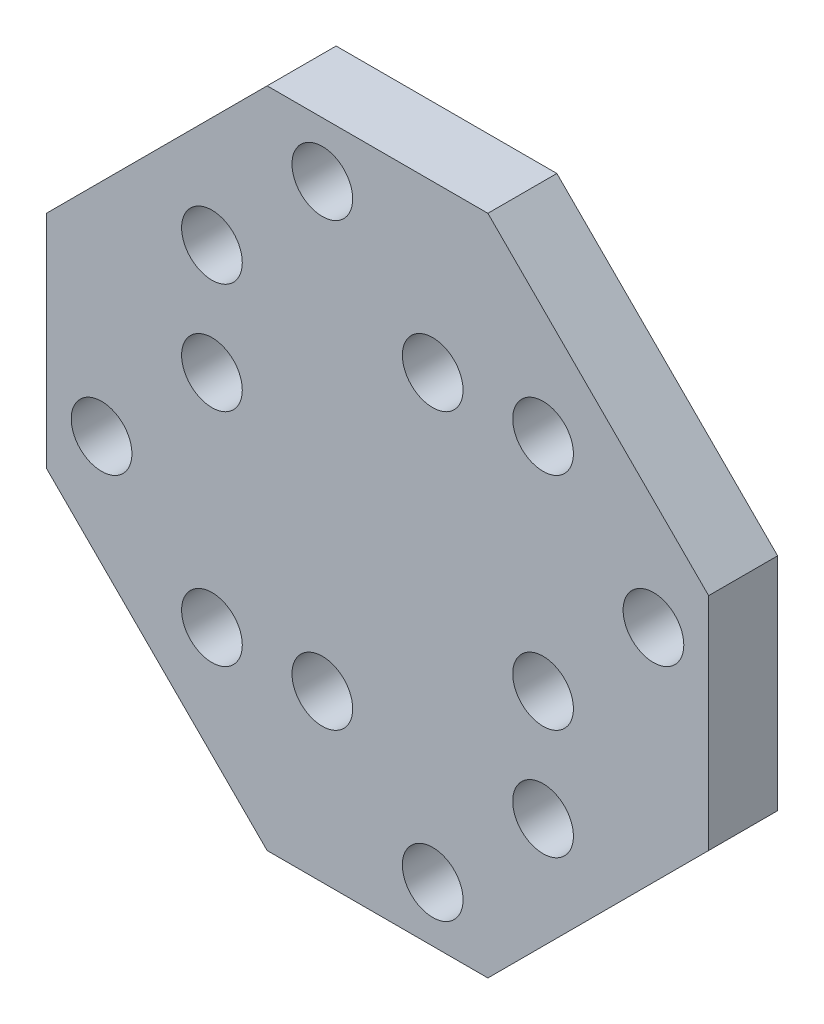
ISO-10303-21;
HEADER;
FILE_DESCRIPTION(('STEP AP214'),'2;1');
FILE_NAME('part.step','',(''),(''),'','','');
FILE_SCHEMA(('AUTOMOTIVE_DESIGN { 1 0 10303 214 1 1 1 1 }'));
ENDSEC;
DATA;
#1=APPLICATION_CONTEXT('core data for automotive mechanical design processes');
#2=APPLICATION_PROTOCOL_DEFINITION('international standard','automotive_design',2000,#1);
#3=PRODUCT_CONTEXT('',#1,'mechanical');
#4=PRODUCT('Part','Part','',(#3));
#5=PRODUCT_RELATED_PRODUCT_CATEGORY('part','',(#4));
#6=PRODUCT_DEFINITION_FORMATION('','',#4);
#7=PRODUCT_DEFINITION_CONTEXT('part definition',#1,'design');
#8=PRODUCT_DEFINITION('design','',#6,#7);
#9=PRODUCT_DEFINITION_SHAPE('','',#8);
#10=(LENGTH_UNIT() NAMED_UNIT(*) SI_UNIT(.MILLI.,.METRE.));
#11=(NAMED_UNIT(*) PLANE_ANGLE_UNIT() SI_UNIT($,.RADIAN.));
#12=(NAMED_UNIT(*) SI_UNIT($,.STERADIAN.) SOLID_ANGLE_UNIT());
#13=UNCERTAINTY_MEASURE_WITH_UNIT(LENGTH_MEASURE(1.E-05),#10,'distance_accuracy_value','');
#14=(GEOMETRIC_REPRESENTATION_CONTEXT(3) GLOBAL_UNCERTAINTY_ASSIGNED_CONTEXT((#13)) GLOBAL_UNIT_ASSIGNED_CONTEXT((#10,
#11,#12)) REPRESENTATION_CONTEXT('',''));
#15=CARTESIAN_POINT('',(0.,0.,0.));
#16=DIRECTION('',(0.,0.,1.));
#17=DIRECTION('',(1.,0.,0.));
#18=AXIS2_PLACEMENT_3D('',#15,#16,#17);
#19=CARTESIAN_POINT('',(0.,0.,2.5));
#20=DIRECTION('',(0.,0.,1.));
#21=DIRECTION('',(1.,0.,0.));
#22=AXIS2_PLACEMENT_3D('',#19,#20,#21);
#23=PLANE('',#22);
#24=CARTESIAN_POINT('',(6.,-6.,2.5));
#25=DIRECTION('',(0.,0.,1.));
#26=DIRECTION('',(1.,0.,0.));
#27=AXIS2_PLACEMENT_3D('',#24,#25,#26);
#28=CIRCLE('',#27,1.1);
#29=CARTESIAN_POINT('',(7.1,-6.,2.5));
#30=VERTEX_POINT('',#29);
#31=EDGE_CURVE('E240',#30,#30,#28,.T.);
#32=ORIENTED_EDGE('',*,*,#31,.F.);
#33=EDGE_LOOP('',(#32));
#34=FACE_BOUND('',#33,.T.);
#35=CARTESIAN_POINT('',(6.,6.,2.5));
#36=DIRECTION('',(0.,0.,1.));
#37=DIRECTION('',(1.,0.,0.));
#38=AXIS2_PLACEMENT_3D('',#35,#36,#37);
#39=CIRCLE('',#38,1.1);
#40=CARTESIAN_POINT('',(7.1,6.,2.5));
#41=VERTEX_POINT('',#40);
#42=EDGE_CURVE('E228',#41,#41,#39,.T.);
#43=ORIENTED_EDGE('',*,*,#42,.F.);
#44=EDGE_LOOP('',(#43));
#45=FACE_BOUND('',#44,.T.);
#46=CARTESIAN_POINT('',(-6.,2.,2.5));
#47=DIRECTION('',(0.,0.,1.));
#48=DIRECTION('',(1.,0.,0.));
#49=AXIS2_PLACEMENT_3D('',#46,#47,#48);
#50=CIRCLE('',#49,1.1);
#51=CARTESIAN_POINT('',(-4.9,2.,2.5));
#52=VERTEX_POINT('',#51);
#53=EDGE_CURVE('E216',#52,#52,#50,.T.);
#54=ORIENTED_EDGE('',*,*,#53,.F.);
#55=EDGE_LOOP('',(#54));
#56=FACE_BOUND('',#55,.T.);
#57=CARTESIAN_POINT('',(2.,-10.,2.5));
#58=DIRECTION('',(0.,0.,1.));
#59=DIRECTION('',(1.,0.,0.));
#60=AXIS2_PLACEMENT_3D('',#57,#58,#59);
#61=CIRCLE('',#60,1.1);
#62=CARTESIAN_POINT('',(3.1,-10.,2.5));
#63=VERTEX_POINT('',#62);
#64=EDGE_CURVE('E204',#63,#63,#61,.T.);
#65=ORIENTED_EDGE('',*,*,#64,.F.);
#66=EDGE_LOOP('',(#65));
#67=FACE_BOUND('',#66,.T.);
#68=CARTESIAN_POINT('',(10.,2.,2.5));
#69=DIRECTION('',(0.,0.,1.));
#70=DIRECTION('',(1.,0.,0.));
#71=AXIS2_PLACEMENT_3D('',#68,#69,#70);
#72=CIRCLE('',#71,1.1);
#73=CARTESIAN_POINT('',(11.1,2.,2.5));
#74=VERTEX_POINT('',#73);
#75=EDGE_CURVE('E192',#74,#74,#72,.T.);
#76=ORIENTED_EDGE('',*,*,#75,.F.);
#77=EDGE_LOOP('',(#76));
#78=FACE_BOUND('',#77,.T.);
#79=CARTESIAN_POINT('',(-2.,10.,2.5));
#80=DIRECTION('',(0.,0.,1.));
#81=DIRECTION('',(1.,0.,0.));
#82=AXIS2_PLACEMENT_3D('',#79,#80,#81);
#83=CIRCLE('',#82,1.1);
#84=CARTESIAN_POINT('',(-0.900000000000001,10.,2.5));
#85=VERTEX_POINT('',#84);
#86=EDGE_CURVE('E138',#85,#85,#83,.T.);
#87=ORIENTED_EDGE('',*,*,#86,.F.);
#88=EDGE_LOOP('',(#87));
#89=FACE_BOUND('',#88,.T.);
#90=DIRECTION('',(-0.707106781186548,0.707106781186548,0.));
#91=VECTOR('',#90,1.);
#92=CARTESIAN_POINT('',(4.,12.,2.5));
#93=LINE('',#92,#91);
#94=CARTESIAN_POINT('',(12.,4.,2.5));
#95=VERTEX_POINT('',#94);
#96=CARTESIAN_POINT('',(4.,12.,2.5));
#97=VERTEX_POINT('',#96);
#98=EDGE_CURVE('E149',#95,#97,#93,.T.);
#99=ORIENTED_EDGE('',*,*,#98,.T.);
#100=DIRECTION('',(-1.,0.,0.));
#101=VECTOR('',#100,1.);
#102=CARTESIAN_POINT('',(-4.,12.,2.5));
#103=LINE('',#102,#101);
#104=CARTESIAN_POINT('',(-4.,12.,2.5));
#105=VERTEX_POINT('',#104);
#106=EDGE_CURVE('E97',#97,#105,#103,.T.);
#107=ORIENTED_EDGE('',*,*,#106,.T.);
#108=DIRECTION('',(-0.707106781186548,-0.707106781186548,0.));
#109=VECTOR('',#108,1.);
#110=CARTESIAN_POINT('',(-4.,12.,2.5));
#111=LINE('',#110,#109);
#112=CARTESIAN_POINT('',(-12.,4.,2.5));
#113=VERTEX_POINT('',#112);
#114=EDGE_CURVE('E164',#105,#113,#111,.T.);
#115=ORIENTED_EDGE('',*,*,#114,.T.);
#116=DIRECTION('',(0.,-1.,0.));
#117=VECTOR('',#116,1.);
#118=CARTESIAN_POINT('',(-12.,4.,2.5));
#119=LINE('',#118,#117);
#120=CARTESIAN_POINT('',(-12.,-4.,2.5));
#121=VERTEX_POINT('',#120);
#122=EDGE_CURVE('E177',#113,#121,#119,.T.);
#123=ORIENTED_EDGE('',*,*,#122,.T.);
#124=DIRECTION('',(0.707106781186548,-0.707106781186548,0.));
#125=VECTOR('',#124,1.);
#126=CARTESIAN_POINT('',(-12.,-4.,2.5));
#127=LINE('',#126,#125);
#128=CARTESIAN_POINT('',(-4.,-12.,2.5));
#129=VERTEX_POINT('',#128);
#130=EDGE_CURVE('E116',#121,#129,#127,.T.);
#131=ORIENTED_EDGE('',*,*,#130,.T.);
#132=DIRECTION('',(1.,0.,0.));
#133=VECTOR('',#132,1.);
#134=CARTESIAN_POINT('',(-4.,-12.,2.5));
#135=LINE('',#134,#133);
#136=CARTESIAN_POINT('',(4.,-12.,2.5));
#137=VERTEX_POINT('',#136);
#138=EDGE_CURVE('E110',#129,#137,#135,.T.);
#139=ORIENTED_EDGE('',*,*,#138,.T.);
#140=DIRECTION('',(0.707106781186548,0.707106781186548,0.));
#141=VECTOR('',#140,1.);
#142=CARTESIAN_POINT('',(4.,-12.,2.5));
#143=LINE('',#142,#141);
#144=CARTESIAN_POINT('',(12.,-4.,2.5));
#145=VERTEX_POINT('',#144);
#146=EDGE_CURVE('E114',#137,#145,#143,.T.);
#147=ORIENTED_EDGE('',*,*,#146,.T.);
#148=DIRECTION('',(0.,1.,0.));
#149=VECTOR('',#148,1.);
#150=CARTESIAN_POINT('',(12.,-4.,2.5));
#151=LINE('',#150,#149);
#152=EDGE_CURVE('E54',#145,#95,#151,.T.);
#153=ORIENTED_EDGE('',*,*,#152,.T.);
#154=EDGE_LOOP('',(#99,#107,#115,#123,#131,#139,#147,#153));
#155=FACE_BOUND('',#154,.T.);
#156=CARTESIAN_POINT('',(2.,6.,2.5));
#157=DIRECTION('',(0.,0.,1.));
#158=DIRECTION('',(1.,0.,0.));
#159=AXIS2_PLACEMENT_3D('',#156,#157,#158);
#160=CIRCLE('',#159,1.1);
#161=CARTESIAN_POINT('',(3.1,6.,2.5));
#162=VERTEX_POINT('',#161);
#163=EDGE_CURVE('E186',#162,#162,#160,.T.);
#164=ORIENTED_EDGE('',*,*,#163,.F.);
#165=EDGE_LOOP('',(#164));
#166=FACE_BOUND('',#165,.T.);
#167=CARTESIAN_POINT('',(6.,-2.,2.5));
#168=DIRECTION('',(0.,0.,1.));
#169=DIRECTION('',(1.,0.,0.));
#170=AXIS2_PLACEMENT_3D('',#167,#168,#169);
#171=CIRCLE('',#170,1.1);
#172=CARTESIAN_POINT('',(7.1,-2.,2.5));
#173=VERTEX_POINT('',#172);
#174=EDGE_CURVE('E198',#173,#173,#171,.T.);
#175=ORIENTED_EDGE('',*,*,#174,.F.);
#176=EDGE_LOOP('',(#175));
#177=FACE_BOUND('',#176,.T.);
#178=CARTESIAN_POINT('',(-2.,-6.,2.5));
#179=DIRECTION('',(0.,0.,1.));
#180=DIRECTION('',(1.,0.,0.));
#181=AXIS2_PLACEMENT_3D('',#178,#179,#180);
#182=CIRCLE('',#181,1.1);
#183=CARTESIAN_POINT('',(-0.899999999999999,-6.,2.5));
#184=VERTEX_POINT('',#183);
#185=EDGE_CURVE('E210',#184,#184,#182,.T.);
#186=ORIENTED_EDGE('',*,*,#185,.F.);
#187=EDGE_LOOP('',(#186));
#188=FACE_BOUND('',#187,.T.);
#189=CARTESIAN_POINT('',(-10.,-2.,2.5));
#190=DIRECTION('',(0.,0.,1.));
#191=DIRECTION('',(1.,0.,0.));
#192=AXIS2_PLACEMENT_3D('',#189,#190,#191);
#193=CIRCLE('',#192,1.1);
#194=CARTESIAN_POINT('',(-8.9,-2.,2.5));
#195=VERTEX_POINT('',#194);
#196=EDGE_CURVE('E222',#195,#195,#193,.T.);
#197=ORIENTED_EDGE('',*,*,#196,.F.);
#198=EDGE_LOOP('',(#197));
#199=FACE_BOUND('',#198,.T.);
#200=CARTESIAN_POINT('',(-6.,5.99999999999999,2.5));
#201=DIRECTION('',(0.,0.,1.));
#202=DIRECTION('',(1.,0.,0.));
#203=AXIS2_PLACEMENT_3D('',#200,#201,#202);
#204=CIRCLE('',#203,1.1);
#205=CARTESIAN_POINT('',(-4.9,5.99999999999999,2.5));
#206=VERTEX_POINT('',#205);
#207=EDGE_CURVE('E234',#206,#206,#204,.T.);
#208=ORIENTED_EDGE('',*,*,#207,.F.);
#209=EDGE_LOOP('',(#208));
#210=FACE_BOUND('',#209,.T.);
#211=CARTESIAN_POINT('',(-6.,-6.,2.5));
#212=DIRECTION('',(0.,0.,1.));
#213=DIRECTION('',(1.,0.,0.));
#214=AXIS2_PLACEMENT_3D('',#211,#212,#213);
#215=CIRCLE('',#214,1.1);
#216=CARTESIAN_POINT('',(-4.9,-6.,2.5));
#217=VERTEX_POINT('',#216);
#218=EDGE_CURVE('E246',#217,#217,#215,.T.);
#219=ORIENTED_EDGE('',*,*,#218,.F.);
#220=EDGE_LOOP('',(#219));
#221=FACE_BOUND('',#220,.T.);
#222=ADVANCED_FACE('F37',(#34,#45,#56,#67,#78,#89,#155,#166,#177,#188,#199,#210,#221),#23,.T.);
#223=CARTESIAN_POINT('',(0.,0.,0.));
#224=DIRECTION('',(0.,0.,1.));
#225=DIRECTION('',(1.,0.,0.));
#226=AXIS2_PLACEMENT_3D('',#223,#224,#225);
#227=PLANE('',#226);
#228=DIRECTION('',(-0.707106781186548,0.707106781186548,0.));
#229=VECTOR('',#228,1.);
#230=CARTESIAN_POINT('',(4.,12.,0.));
#231=LINE('',#230,#229);
#232=CARTESIAN_POINT('',(12.,4.,0.));
#233=VERTEX_POINT('',#232);
#234=CARTESIAN_POINT('',(4.,12.,0.));
#235=VERTEX_POINT('',#234);
#236=EDGE_CURVE('E134',#233,#235,#231,.T.);
#237=ORIENTED_EDGE('',*,*,#236,.F.);
#238=DIRECTION('',(0.,1.,0.));
#239=VECTOR('',#238,1.);
#240=CARTESIAN_POINT('',(12.,-4.,0.));
#241=LINE('',#240,#239);
#242=CARTESIAN_POINT('',(12.,-4.,0.));
#243=VERTEX_POINT('',#242);
#244=EDGE_CURVE('E89',#243,#233,#241,.T.);
#245=ORIENTED_EDGE('',*,*,#244,.F.);
#246=DIRECTION('',(0.707106781186548,0.707106781186548,0.));
#247=VECTOR('',#246,1.);
#248=CARTESIAN_POINT('',(4.,-12.,0.));
#249=LINE('',#248,#247);
#250=CARTESIAN_POINT('',(4.,-12.,0.));
#251=VERTEX_POINT('',#250);
#252=EDGE_CURVE('E83',#251,#243,#249,.T.);
#253=ORIENTED_EDGE('',*,*,#252,.F.);
#254=DIRECTION('',(1.,0.,0.));
#255=VECTOR('',#254,1.);
#256=CARTESIAN_POINT('',(-4.,-12.,0.));
#257=LINE('',#256,#255);
#258=CARTESIAN_POINT('',(-4.,-12.,0.));
#259=VERTEX_POINT('',#258);
#260=EDGE_CURVE('E124',#259,#251,#257,.T.);
#261=ORIENTED_EDGE('',*,*,#260,.F.);
#262=DIRECTION('',(0.707106781186548,-0.707106781186548,0.));
#263=VECTOR('',#262,1.);
#264=CARTESIAN_POINT('',(-12.,-4.,0.));
#265=LINE('',#264,#263);
#266=CARTESIAN_POINT('',(-12.,-4.,0.));
#267=VERTEX_POINT('',#266);
#268=EDGE_CURVE('E144',#267,#259,#265,.T.);
#269=ORIENTED_EDGE('',*,*,#268,.F.);
#270=DIRECTION('',(0.,-1.,0.));
#271=VECTOR('',#270,1.);
#272=CARTESIAN_POINT('',(-12.,4.,0.));
#273=LINE('',#272,#271);
#274=CARTESIAN_POINT('',(-12.,4.,0.));
#275=VERTEX_POINT('',#274);
#276=EDGE_CURVE('E142',#275,#267,#273,.T.);
#277=ORIENTED_EDGE('',*,*,#276,.F.);
#278=DIRECTION('',(-0.707106781186548,-0.707106781186548,0.));
#279=VECTOR('',#278,1.);
#280=CARTESIAN_POINT('',(-4.,12.,0.));
#281=LINE('',#280,#279);
#282=CARTESIAN_POINT('',(-4.,12.,0.));
#283=VERTEX_POINT('',#282);
#284=EDGE_CURVE('E140',#283,#275,#281,.T.);
#285=ORIENTED_EDGE('',*,*,#284,.F.);
#286=DIRECTION('',(-1.,0.,0.));
#287=VECTOR('',#286,1.);
#288=CARTESIAN_POINT('',(-4.,12.,0.));
#289=LINE('',#288,#287);
#290=EDGE_CURVE('E137',#235,#283,#289,.T.);
#291=ORIENTED_EDGE('',*,*,#290,.F.);
#292=EDGE_LOOP('',(#237,#245,#253,#261,#269,#277,#285,#291));
#293=FACE_BOUND('',#292,.T.);
#294=CARTESIAN_POINT('',(-2.,10.,0.));
#295=DIRECTION('',(0.,0.,1.));
#296=DIRECTION('',(1.,0.,0.));
#297=AXIS2_PLACEMENT_3D('',#294,#295,#296);
#298=CIRCLE('',#297,1.1);
#299=CARTESIAN_POINT('',(-0.900000000000001,10.,0.));
#300=VERTEX_POINT('',#299);
#301=EDGE_CURVE('E183',#300,#300,#298,.T.);
#302=ORIENTED_EDGE('',*,*,#301,.T.);
#303=EDGE_LOOP('',(#302));
#304=FACE_BOUND('',#303,.T.);
#305=CARTESIAN_POINT('',(2.,6.,0.));
#306=DIRECTION('',(0.,0.,1.));
#307=DIRECTION('',(1.,0.,0.));
#308=AXIS2_PLACEMENT_3D('',#305,#306,#307);
#309=CIRCLE('',#308,1.1);
#310=CARTESIAN_POINT('',(3.1,6.,0.));
#311=VERTEX_POINT('',#310);
#312=EDGE_CURVE('E189',#311,#311,#309,.T.);
#313=ORIENTED_EDGE('',*,*,#312,.T.);
#314=EDGE_LOOP('',(#313));
#315=FACE_BOUND('',#314,.T.);
#316=CARTESIAN_POINT('',(10.,2.,0.));
#317=DIRECTION('',(0.,0.,1.));
#318=DIRECTION('',(1.,0.,0.));
#319=AXIS2_PLACEMENT_3D('',#316,#317,#318);
#320=CIRCLE('',#319,1.1);
#321=CARTESIAN_POINT('',(11.1,2.,0.));
#322=VERTEX_POINT('',#321);
#323=EDGE_CURVE('E195',#322,#322,#320,.T.);
#324=ORIENTED_EDGE('',*,*,#323,.T.);
#325=EDGE_LOOP('',(#324));
#326=FACE_BOUND('',#325,.T.);
#327=CARTESIAN_POINT('',(6.,-2.,0.));
#328=DIRECTION('',(0.,0.,1.));
#329=DIRECTION('',(1.,0.,0.));
#330=AXIS2_PLACEMENT_3D('',#327,#328,#329);
#331=CIRCLE('',#330,1.1);
#332=CARTESIAN_POINT('',(7.1,-2.,0.));
#333=VERTEX_POINT('',#332);
#334=EDGE_CURVE('E201',#333,#333,#331,.T.);
#335=ORIENTED_EDGE('',*,*,#334,.T.);
#336=EDGE_LOOP('',(#335));
#337=FACE_BOUND('',#336,.T.);
#338=CARTESIAN_POINT('',(2.,-10.,0.));
#339=DIRECTION('',(0.,0.,1.));
#340=DIRECTION('',(1.,0.,0.));
#341=AXIS2_PLACEMENT_3D('',#338,#339,#340);
#342=CIRCLE('',#341,1.1);
#343=CARTESIAN_POINT('',(3.1,-10.,0.));
#344=VERTEX_POINT('',#343);
#345=EDGE_CURVE('E207',#344,#344,#342,.T.);
#346=ORIENTED_EDGE('',*,*,#345,.T.);
#347=EDGE_LOOP('',(#346));
#348=FACE_BOUND('',#347,.T.);
#349=CARTESIAN_POINT('',(-2.,-6.,0.));
#350=DIRECTION('',(0.,0.,1.));
#351=DIRECTION('',(1.,0.,0.));
#352=AXIS2_PLACEMENT_3D('',#349,#350,#351);
#353=CIRCLE('',#352,1.1);
#354=CARTESIAN_POINT('',(-0.899999999999999,-6.,0.));
#355=VERTEX_POINT('',#354);
#356=EDGE_CURVE('E213',#355,#355,#353,.T.);
#357=ORIENTED_EDGE('',*,*,#356,.T.);
#358=EDGE_LOOP('',(#357));
#359=FACE_BOUND('',#358,.T.);
#360=CARTESIAN_POINT('',(-6.,2.,0.));
#361=DIRECTION('',(0.,0.,1.));
#362=DIRECTION('',(1.,0.,0.));
#363=AXIS2_PLACEMENT_3D('',#360,#361,#362);
#364=CIRCLE('',#363,1.1);
#365=CARTESIAN_POINT('',(-4.9,2.,0.));
#366=VERTEX_POINT('',#365);
#367=EDGE_CURVE('E219',#366,#366,#364,.T.);
#368=ORIENTED_EDGE('',*,*,#367,.T.);
#369=EDGE_LOOP('',(#368));
#370=FACE_BOUND('',#369,.T.);
#371=CARTESIAN_POINT('',(-10.,-2.,0.));
#372=DIRECTION('',(0.,0.,1.));
#373=DIRECTION('',(1.,0.,0.));
#374=AXIS2_PLACEMENT_3D('',#371,#372,#373);
#375=CIRCLE('',#374,1.1);
#376=CARTESIAN_POINT('',(-8.9,-2.,0.));
#377=VERTEX_POINT('',#376);
#378=EDGE_CURVE('E225',#377,#377,#375,.T.);
#379=ORIENTED_EDGE('',*,*,#378,.T.);
#380=EDGE_LOOP('',(#379));
#381=FACE_BOUND('',#380,.T.);
#382=CARTESIAN_POINT('',(6.,6.,0.));
#383=DIRECTION('',(0.,0.,1.));
#384=DIRECTION('',(1.,0.,0.));
#385=AXIS2_PLACEMENT_3D('',#382,#383,#384);
#386=CIRCLE('',#385,1.1);
#387=CARTESIAN_POINT('',(7.1,6.,0.));
#388=VERTEX_POINT('',#387);
#389=EDGE_CURVE('E231',#388,#388,#386,.T.);
#390=ORIENTED_EDGE('',*,*,#389,.T.);
#391=EDGE_LOOP('',(#390));
#392=FACE_BOUND('',#391,.T.);
#393=CARTESIAN_POINT('',(-6.,5.99999999999999,0.));
#394=DIRECTION('',(0.,0.,1.));
#395=DIRECTION('',(1.,0.,0.));
#396=AXIS2_PLACEMENT_3D('',#393,#394,#395);
#397=CIRCLE('',#396,1.1);
#398=CARTESIAN_POINT('',(-4.9,5.99999999999999,0.));
#399=VERTEX_POINT('',#398);
#400=EDGE_CURVE('E237',#399,#399,#397,.T.);
#401=ORIENTED_EDGE('',*,*,#400,.T.);
#402=EDGE_LOOP('',(#401));
#403=FACE_BOUND('',#402,.T.);
#404=CARTESIAN_POINT('',(6.,-6.,0.));
#405=DIRECTION('',(0.,0.,1.));
#406=DIRECTION('',(1.,0.,0.));
#407=AXIS2_PLACEMENT_3D('',#404,#405,#406);
#408=CIRCLE('',#407,1.1);
#409=CARTESIAN_POINT('',(7.1,-6.,0.));
#410=VERTEX_POINT('',#409);
#411=EDGE_CURVE('E243',#410,#410,#408,.T.);
#412=ORIENTED_EDGE('',*,*,#411,.T.);
#413=EDGE_LOOP('',(#412));
#414=FACE_BOUND('',#413,.T.);
#415=CARTESIAN_POINT('',(-6.,-6.,0.));
#416=DIRECTION('',(0.,0.,1.));
#417=DIRECTION('',(1.,0.,0.));
#418=AXIS2_PLACEMENT_3D('',#415,#416,#417);
#419=CIRCLE('',#418,1.1);
#420=CARTESIAN_POINT('',(-4.9,-6.,0.));
#421=VERTEX_POINT('',#420);
#422=EDGE_CURVE('E249',#421,#421,#419,.T.);
#423=ORIENTED_EDGE('',*,*,#422,.T.);
#424=EDGE_LOOP('',(#423));
#425=FACE_BOUND('',#424,.T.);
#426=ADVANCED_FACE('F168',(#293,#304,#315,#326,#337,#348,#359,#370,#381,#392,#403,#414,#425),
#227,.F.);
#427=CARTESIAN_POINT('',(4.,12.,2.5));
#428=DIRECTION('',(-0.707106781186548,-0.707106781186548,0.));
#429=DIRECTION('',(0.707106781186548,-0.707106781186548,0.));
#430=AXIS2_PLACEMENT_3D('',#427,#428,#429);
#431=PLANE('',#430);
#432=ORIENTED_EDGE('',*,*,#236,.T.);
#433=DIRECTION('',(0.,0.,-1.));
#434=VECTOR('',#433,1.);
#435=CARTESIAN_POINT('',(4.,12.,2.5));
#436=LINE('',#435,#434);
#437=EDGE_CURVE('E11',#97,#235,#436,.T.);
#438=ORIENTED_EDGE('',*,*,#437,.F.);
#439=ORIENTED_EDGE('',*,*,#98,.F.);
#440=DIRECTION('',(0.,0.,-1.));
#441=VECTOR('',#440,1.);
#442=CARTESIAN_POINT('',(12.,4.,2.5));
#443=LINE('',#442,#441);
#444=EDGE_CURVE('E130',#95,#233,#443,.T.);
#445=ORIENTED_EDGE('',*,*,#444,.T.);
#446=EDGE_LOOP('',(#432,#438,#439,#445));
#447=FACE_BOUND('',#446,.T.);
#448=ADVANCED_FACE('F39',(#447),#431,.F.);
#449=CARTESIAN_POINT('',(-4.,12.,2.5));
#450=DIRECTION('',(0.,-1.,0.));
#451=DIRECTION('',(0.,0.,-1.));
#452=AXIS2_PLACEMENT_3D('',#449,#450,#451);
#453=PLANE('',#452);
#454=ORIENTED_EDGE('',*,*,#290,.T.);
#455=DIRECTION('',(0.,0.,-1.));
#456=VECTOR('',#455,1.);
#457=CARTESIAN_POINT('',(-4.,12.,2.5));
#458=LINE('',#457,#456);
#459=EDGE_CURVE('E46',#105,#283,#458,.T.);
#460=ORIENTED_EDGE('',*,*,#459,.F.);
#461=ORIENTED_EDGE('',*,*,#106,.F.);
#462=ORIENTED_EDGE('',*,*,#437,.T.);
#463=EDGE_LOOP('',(#454,#460,#461,#462));
#464=FACE_BOUND('',#463,.T.);
#465=ADVANCED_FACE('F283',(#464),#453,.F.);
#466=CARTESIAN_POINT('',(-4.,12.,2.5));
#467=DIRECTION('',(0.707106781186548,-0.707106781186548,0.));
#468=DIRECTION('',(0.707106781186548,0.707106781186548,0.));
#469=AXIS2_PLACEMENT_3D('',#466,#467,#468);
#470=PLANE('',#469);
#471=ORIENTED_EDGE('',*,*,#284,.T.);
#472=DIRECTION('',(0.,0.,-1.));
#473=VECTOR('',#472,1.);
#474=CARTESIAN_POINT('',(-12.,4.,2.5));
#475=LINE('',#474,#473);
#476=EDGE_CURVE('E156',#113,#275,#475,.T.);
#477=ORIENTED_EDGE('',*,*,#476,.F.);
#478=ORIENTED_EDGE('',*,*,#114,.F.);
#479=ORIENTED_EDGE('',*,*,#459,.T.);
#480=EDGE_LOOP('',(#471,#477,#478,#479));
#481=FACE_BOUND('',#480,.T.);
#482=ADVANCED_FACE('F162',(#481),#470,.F.);
#483=CARTESIAN_POINT('',(-12.,4.,2.5));
#484=DIRECTION('',(1.,0.,0.));
#485=DIRECTION('',(0.,1.,0.));
#486=AXIS2_PLACEMENT_3D('',#483,#484,#485);
#487=PLANE('',#486);
#488=ORIENTED_EDGE('',*,*,#276,.T.);
#489=DIRECTION('',(0.,0.,-1.));
#490=VECTOR('',#489,1.);
#491=CARTESIAN_POINT('',(-12.,-4.,2.5));
#492=LINE('',#491,#490);
#493=EDGE_CURVE('E153',#121,#267,#492,.T.);
#494=ORIENTED_EDGE('',*,*,#493,.F.);
#495=ORIENTED_EDGE('',*,*,#122,.F.);
#496=ORIENTED_EDGE('',*,*,#476,.T.);
#497=EDGE_LOOP('',(#488,#494,#495,#496));
#498=FACE_BOUND('',#497,.T.);
#499=ADVANCED_FACE('F173',(#498),#487,.F.);
#500=CARTESIAN_POINT('',(-12.,-4.,2.5));
#501=DIRECTION('',(0.707106781186548,0.707106781186548,0.));
#502=DIRECTION('',(-0.707106781186548,0.707106781186548,0.));
#503=AXIS2_PLACEMENT_3D('',#500,#501,#502);
#504=PLANE('',#503);
#505=ORIENTED_EDGE('',*,*,#268,.T.);
#506=DIRECTION('',(0.,0.,-1.));
#507=VECTOR('',#506,1.);
#508=CARTESIAN_POINT('',(-4.,-12.,2.5));
#509=LINE('',#508,#507);
#510=EDGE_CURVE('E125',#129,#259,#509,.T.);
#511=ORIENTED_EDGE('',*,*,#510,.F.);
#512=ORIENTED_EDGE('',*,*,#130,.F.);
#513=ORIENTED_EDGE('',*,*,#493,.T.);
#514=EDGE_LOOP('',(#505,#511,#512,#513));
#515=FACE_BOUND('',#514,.T.);
#516=ADVANCED_FACE('F176',(#515),#504,.F.);
#517=CARTESIAN_POINT('',(-4.,-12.,2.5));
#518=DIRECTION('',(0.,1.,0.));
#519=DIRECTION('',(0.,0.,1.));
#520=AXIS2_PLACEMENT_3D('',#517,#518,#519);
#521=PLANE('',#520);
#522=ORIENTED_EDGE('',*,*,#260,.T.);
#523=DIRECTION('',(0.,0.,-1.));
#524=VECTOR('',#523,1.);
#525=CARTESIAN_POINT('',(4.,-12.,2.5));
#526=LINE('',#525,#524);
#527=EDGE_CURVE('E121',#137,#251,#526,.T.);
#528=ORIENTED_EDGE('',*,*,#527,.F.);
#529=ORIENTED_EDGE('',*,*,#138,.F.);
#530=ORIENTED_EDGE('',*,*,#510,.T.);
#531=EDGE_LOOP('',(#522,#528,#529,#530));
#532=FACE_BOUND('',#531,.T.);
#533=ADVANCED_FACE('F122',(#532),#521,.F.);
#534=CARTESIAN_POINT('',(4.,-12.,2.5));
#535=DIRECTION('',(-0.707106781186548,0.707106781186548,0.));
#536=DIRECTION('',(-0.707106781186548,-0.707106781186548,0.));
#537=AXIS2_PLACEMENT_3D('',#534,#535,#536);
#538=PLANE('',#537);
#539=ORIENTED_EDGE('',*,*,#252,.T.);
#540=DIRECTION('',(0.,0.,-1.));
#541=VECTOR('',#540,1.);
#542=CARTESIAN_POINT('',(12.,-4.,2.5));
#543=LINE('',#542,#541);
#544=EDGE_CURVE('E126',#145,#243,#543,.T.);
#545=ORIENTED_EDGE('',*,*,#544,.F.);
#546=ORIENTED_EDGE('',*,*,#146,.F.);
#547=ORIENTED_EDGE('',*,*,#527,.T.);
#548=EDGE_LOOP('',(#539,#545,#546,#547));
#549=FACE_BOUND('',#548,.T.);
#550=ADVANCED_FACE('F128',(#549),#538,.F.);
#551=CARTESIAN_POINT('',(12.,-4.,2.5));
#552=DIRECTION('',(-1.,0.,0.));
#553=DIRECTION('',(0.,0.,1.));
#554=AXIS2_PLACEMENT_3D('',#551,#552,#553);
#555=PLANE('',#554);
#556=ORIENTED_EDGE('',*,*,#244,.T.);
#557=ORIENTED_EDGE('',*,*,#444,.F.);
#558=ORIENTED_EDGE('',*,*,#152,.F.);
#559=ORIENTED_EDGE('',*,*,#544,.T.);
#560=EDGE_LOOP('',(#556,#557,#558,#559));
#561=FACE_BOUND('',#560,.T.);
#562=ADVANCED_FACE('F271',(#561),#555,.F.);
#563=CARTESIAN_POINT('',(-2.,10.,2.5));
#564=DIRECTION('',(0.,0.,-1.));
#565=DIRECTION('',(-1.,0.,0.));
#566=AXIS2_PLACEMENT_3D('',#563,#564,#565);
#567=CYLINDRICAL_SURFACE('',#566,1.1);
#568=ORIENTED_EDGE('',*,*,#86,.T.);
#569=EDGE_LOOP('',(#568));
#570=FACE_BOUND('',#569,.T.);
#571=ORIENTED_EDGE('',*,*,#301,.F.);
#572=EDGE_LOOP('',(#571));
#573=FACE_BOUND('',#572,.T.);
#574=ADVANCED_FACE('F268',(#570,#573),#567,.F.);
#575=CARTESIAN_POINT('',(2.,6.,2.5));
#576=DIRECTION('',(0.,0.,-1.));
#577=DIRECTION('',(-1.,0.,0.));
#578=AXIS2_PLACEMENT_3D('',#575,#576,#577);
#579=CYLINDRICAL_SURFACE('',#578,1.1);
#580=ORIENTED_EDGE('',*,*,#163,.T.);
#581=EDGE_LOOP('',(#580));
#582=FACE_BOUND('',#581,.T.);
#583=ORIENTED_EDGE('',*,*,#312,.F.);
#584=EDGE_LOOP('',(#583));
#585=FACE_BOUND('',#584,.T.);
#586=ADVANCED_FACE('F347',(#582,#585),#579,.F.);
#587=CARTESIAN_POINT('',(10.,2.,2.5));
#588=DIRECTION('',(0.,0.,-1.));
#589=DIRECTION('',(-1.,0.,0.));
#590=AXIS2_PLACEMENT_3D('',#587,#588,#589);
#591=CYLINDRICAL_SURFACE('',#590,1.1);
#592=ORIENTED_EDGE('',*,*,#75,.T.);
#593=EDGE_LOOP('',(#592));
#594=FACE_BOUND('',#593,.T.);
#595=ORIENTED_EDGE('',*,*,#323,.F.);
#596=EDGE_LOOP('',(#595));
#597=FACE_BOUND('',#596,.T.);
#598=ADVANCED_FACE('F355',(#594,#597),#591,.F.);
#599=CARTESIAN_POINT('',(6.,-2.,2.5));
#600=DIRECTION('',(0.,0.,-1.));
#601=DIRECTION('',(-1.,0.,0.));
#602=AXIS2_PLACEMENT_3D('',#599,#600,#601);
#603=CYLINDRICAL_SURFACE('',#602,1.1);
#604=ORIENTED_EDGE('',*,*,#174,.T.);
#605=EDGE_LOOP('',(#604));
#606=FACE_BOUND('',#605,.T.);
#607=ORIENTED_EDGE('',*,*,#334,.F.);
#608=EDGE_LOOP('',(#607));
#609=FACE_BOUND('',#608,.T.);
#610=ADVANCED_FACE('F363',(#606,#609),#603,.F.);
#611=CARTESIAN_POINT('',(2.,-10.,2.5));
#612=DIRECTION('',(0.,0.,-1.));
#613=DIRECTION('',(-1.,0.,0.));
#614=AXIS2_PLACEMENT_3D('',#611,#612,#613);
#615=CYLINDRICAL_SURFACE('',#614,1.1);
#616=ORIENTED_EDGE('',*,*,#64,.T.);
#617=EDGE_LOOP('',(#616));
#618=FACE_BOUND('',#617,.T.);
#619=ORIENTED_EDGE('',*,*,#345,.F.);
#620=EDGE_LOOP('',(#619));
#621=FACE_BOUND('',#620,.T.);
#622=ADVANCED_FACE('F372',(#618,#621),#615,.F.);
#623=CARTESIAN_POINT('',(-2.,-6.,2.5));
#624=DIRECTION('',(0.,0.,-1.));
#625=DIRECTION('',(-1.,0.,0.));
#626=AXIS2_PLACEMENT_3D('',#623,#624,#625);
#627=CYLINDRICAL_SURFACE('',#626,1.1);
#628=ORIENTED_EDGE('',*,*,#185,.T.);
#629=EDGE_LOOP('',(#628));
#630=FACE_BOUND('',#629,.T.);
#631=ORIENTED_EDGE('',*,*,#356,.F.);
#632=EDGE_LOOP('',(#631));
#633=FACE_BOUND('',#632,.T.);
#634=ADVANCED_FACE('F381',(#630,#633),#627,.F.);
#635=CARTESIAN_POINT('',(-6.,2.,2.5));
#636=DIRECTION('',(0.,0.,-1.));
#637=DIRECTION('',(-1.,0.,0.));
#638=AXIS2_PLACEMENT_3D('',#635,#636,#637);
#639=CYLINDRICAL_SURFACE('',#638,1.1);
#640=ORIENTED_EDGE('',*,*,#53,.T.);
#641=EDGE_LOOP('',(#640));
#642=FACE_BOUND('',#641,.T.);
#643=ORIENTED_EDGE('',*,*,#367,.F.);
#644=EDGE_LOOP('',(#643));
#645=FACE_BOUND('',#644,.T.);
#646=ADVANCED_FACE('F390',(#642,#645),#639,.F.);
#647=CARTESIAN_POINT('',(-10.,-2.,2.5));
#648=DIRECTION('',(0.,0.,-1.));
#649=DIRECTION('',(-1.,0.,0.));
#650=AXIS2_PLACEMENT_3D('',#647,#648,#649);
#651=CYLINDRICAL_SURFACE('',#650,1.1);
#652=ORIENTED_EDGE('',*,*,#196,.T.);
#653=EDGE_LOOP('',(#652));
#654=FACE_BOUND('',#653,.T.);
#655=ORIENTED_EDGE('',*,*,#378,.F.);
#656=EDGE_LOOP('',(#655));
#657=FACE_BOUND('',#656,.T.);
#658=ADVANCED_FACE('F399',(#654,#657),#651,.F.);
#659=CARTESIAN_POINT('',(6.,6.,2.5));
#660=DIRECTION('',(0.,0.,-1.));
#661=DIRECTION('',(-1.,0.,0.));
#662=AXIS2_PLACEMENT_3D('',#659,#660,#661);
#663=CYLINDRICAL_SURFACE('',#662,1.1);
#664=ORIENTED_EDGE('',*,*,#42,.T.);
#665=EDGE_LOOP('',(#664));
#666=FACE_BOUND('',#665,.T.);
#667=ORIENTED_EDGE('',*,*,#389,.F.);
#668=EDGE_LOOP('',(#667));
#669=FACE_BOUND('',#668,.T.);
#670=ADVANCED_FACE('F408',(#666,#669),#663,.F.);
#671=CARTESIAN_POINT('',(-6.,5.99999999999999,2.5));
#672=DIRECTION('',(0.,0.,-1.));
#673=DIRECTION('',(-1.,0.,0.));
#674=AXIS2_PLACEMENT_3D('',#671,#672,#673);
#675=CYLINDRICAL_SURFACE('',#674,1.1);
#676=ORIENTED_EDGE('',*,*,#207,.T.);
#677=EDGE_LOOP('',(#676));
#678=FACE_BOUND('',#677,.T.);
#679=ORIENTED_EDGE('',*,*,#400,.F.);
#680=EDGE_LOOP('',(#679));
#681=FACE_BOUND('',#680,.T.);
#682=ADVANCED_FACE('F417',(#678,#681),#675,.F.);
#683=CARTESIAN_POINT('',(6.,-6.,2.5));
#684=DIRECTION('',(0.,0.,-1.));
#685=DIRECTION('',(-1.,0.,0.));
#686=AXIS2_PLACEMENT_3D('',#683,#684,#685);
#687=CYLINDRICAL_SURFACE('',#686,1.1);
#688=ORIENTED_EDGE('',*,*,#31,.T.);
#689=EDGE_LOOP('',(#688));
#690=FACE_BOUND('',#689,.T.);
#691=ORIENTED_EDGE('',*,*,#411,.F.);
#692=EDGE_LOOP('',(#691));
#693=FACE_BOUND('',#692,.T.);
#694=ADVANCED_FACE('F426',(#690,#693),#687,.F.);
#695=CARTESIAN_POINT('',(-6.,-6.,2.5));
#696=DIRECTION('',(0.,0.,-1.));
#697=DIRECTION('',(-1.,0.,0.));
#698=AXIS2_PLACEMENT_3D('',#695,#696,#697);
#699=CYLINDRICAL_SURFACE('',#698,1.1);
#700=ORIENTED_EDGE('',*,*,#218,.T.);
#701=EDGE_LOOP('',(#700));
#702=FACE_BOUND('',#701,.T.);
#703=ORIENTED_EDGE('',*,*,#422,.F.);
#704=EDGE_LOOP('',(#703));
#705=FACE_BOUND('',#704,.T.);
#706=ADVANCED_FACE('F255',(#702,#705),#699,.F.);
#707=CLOSED_SHELL('',(#222,#426,#448,#465,#482,#499,#516,#533,#550,#562,#574,#586,#598,#610,
#622,#634,#646,#658,#670,#682,#694,#706));
#708=MANIFOLD_SOLID_BREP('B2',#707);
#709=ADVANCED_BREP_SHAPE_REPRESENTATION('',(#18,#708),#14);
#710=SHAPE_DEFINITION_REPRESENTATION(#9,#709);
ENDSEC;
END-ISO-10303-21;
